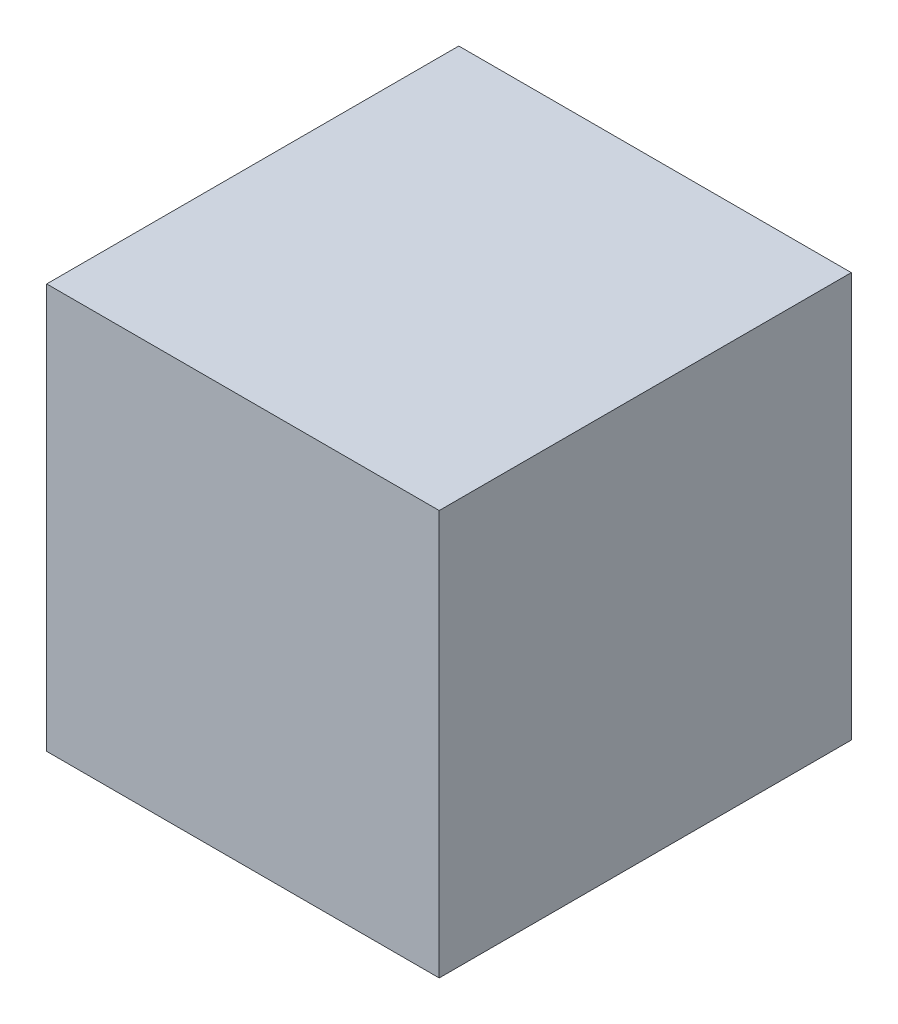
ISO-10303-21;
HEADER;
FILE_DESCRIPTION(('STEP AP214'),'2;1');
FILE_NAME('part.step','',(''),(''),'','','');
FILE_SCHEMA(('AUTOMOTIVE_DESIGN { 1 0 10303 214 1 1 1 1 }'));
ENDSEC;
DATA;
#1=APPLICATION_CONTEXT('core data for automotive mechanical design processes');
#2=APPLICATION_PROTOCOL_DEFINITION('international standard','automotive_design',2000,#1);
#3=PRODUCT_CONTEXT('',#1,'mechanical');
#4=PRODUCT('Part','Part','',(#3));
#5=PRODUCT_RELATED_PRODUCT_CATEGORY('part','',(#4));
#6=PRODUCT_DEFINITION_FORMATION('','',#4);
#7=PRODUCT_DEFINITION_CONTEXT('part definition',#1,'design');
#8=PRODUCT_DEFINITION('design','',#6,#7);
#9=PRODUCT_DEFINITION_SHAPE('','',#8);
#10=(LENGTH_UNIT() NAMED_UNIT(*) SI_UNIT(.MILLI.,.METRE.));
#11=(NAMED_UNIT(*) PLANE_ANGLE_UNIT() SI_UNIT($,.RADIAN.));
#12=(NAMED_UNIT(*) SI_UNIT($,.STERADIAN.) SOLID_ANGLE_UNIT());
#13=UNCERTAINTY_MEASURE_WITH_UNIT(LENGTH_MEASURE(1.E-05),#10,'distance_accuracy_value','');
#14=(GEOMETRIC_REPRESENTATION_CONTEXT(3) GLOBAL_UNCERTAINTY_ASSIGNED_CONTEXT((#13)) GLOBAL_UNIT_ASSIGNED_CONTEXT((#10,
#11,#12)) REPRESENTATION_CONTEXT('',''));
#15=CARTESIAN_POINT('',(0.,0.,0.));
#16=DIRECTION('',(0.,0.,1.));
#17=DIRECTION('',(1.,0.,0.));
#18=AXIS2_PLACEMENT_3D('',#15,#16,#17);
#19=CARTESIAN_POINT('',(0.,-29.6653277972811,40.));
#20=DIRECTION('',(0.,1.,0.));
#21=DIRECTION('',(-1.,0.,0.));
#22=AXIS2_PLACEMENT_3D('',#19,#20,#21);
#23=PLANE('',#22);
#24=DIRECTION('',(1.,0.,0.));
#25=VECTOR('',#24,1.);
#26=CARTESIAN_POINT('',(0.,-29.6653277972811,0.));
#27=LINE('',#26,#25);
#28=CARTESIAN_POINT('',(-9.03314366632912,-29.6653277972811,0.));
#29=VERTEX_POINT('',#28);
#30=CARTESIAN_POINT('',(29.0662585842205,-29.6653277972811,0.));
#31=VERTEX_POINT('',#30);
#32=EDGE_CURVE('E98',#29,#31,#27,.T.);
#33=ORIENTED_EDGE('',*,*,#32,.T.);
#34=DIRECTION('',(0.,0.,-1.));
#35=VECTOR('',#34,1.);
#36=CARTESIAN_POINT('',(29.0662585842205,-29.6653277972811,40.));
#37=LINE('',#36,#35);
#38=CARTESIAN_POINT('',(29.0662585842205,-29.6653277972811,40.));
#39=VERTEX_POINT('',#38);
#40=EDGE_CURVE('E11',#39,#31,#37,.T.);
#41=ORIENTED_EDGE('',*,*,#40,.F.);
#42=DIRECTION('',(1.,0.,0.));
#43=VECTOR('',#42,1.);
#44=CARTESIAN_POINT('',(0.,-29.6653277972811,40.));
#45=LINE('',#44,#43);
#46=CARTESIAN_POINT('',(-9.03314366632912,-29.6653277972811,40.));
#47=VERTEX_POINT('',#46);
#48=EDGE_CURVE('E84',#47,#39,#45,.T.);
#49=ORIENTED_EDGE('',*,*,#48,.F.);
#50=DIRECTION('',(0.,0.,-1.));
#51=VECTOR('',#50,1.);
#52=CARTESIAN_POINT('',(-9.03314366632912,-29.6653277972811,40.));
#53=LINE('',#52,#51);
#54=EDGE_CURVE('E51',#47,#29,#53,.T.);
#55=ORIENTED_EDGE('',*,*,#54,.T.);
#56=EDGE_LOOP('',(#33,#41,#49,#55));
#57=FACE_BOUND('',#56,.T.);
#58=ADVANCED_FACE('F35',(#57),#23,.F.);
#59=CARTESIAN_POINT('',(29.0662585842205,0.,40.));
#60=DIRECTION('',(-1.,0.,0.));
#61=DIRECTION('',(0.,0.,1.));
#62=AXIS2_PLACEMENT_3D('',#59,#60,#61);
#63=PLANE('',#62);
#64=DIRECTION('',(0.,1.,0.));
#65=VECTOR('',#64,1.);
#66=CARTESIAN_POINT('',(29.0662585842205,0.,0.));
#67=LINE('',#66,#65);
#68=CARTESIAN_POINT('',(29.0662585842205,9.63221287938977,0.));
#69=VERTEX_POINT('',#68);
#70=EDGE_CURVE('E89',#31,#69,#67,.T.);
#71=ORIENTED_EDGE('',*,*,#70,.T.);
#72=DIRECTION('',(0.,0.,-1.));
#73=VECTOR('',#72,1.);
#74=CARTESIAN_POINT('',(29.0662585842205,9.63221287938977,40.));
#75=LINE('',#74,#73);
#76=CARTESIAN_POINT('',(29.0662585842205,9.63221287938977,40.));
#77=VERTEX_POINT('',#76);
#78=EDGE_CURVE('E43',#77,#69,#75,.T.);
#79=ORIENTED_EDGE('',*,*,#78,.F.);
#80=DIRECTION('',(0.,1.,0.));
#81=VECTOR('',#80,1.);
#82=CARTESIAN_POINT('',(29.0662585842205,0.,40.));
#83=LINE('',#82,#81);
#84=EDGE_CURVE('E76',#39,#77,#83,.T.);
#85=ORIENTED_EDGE('',*,*,#84,.F.);
#86=ORIENTED_EDGE('',*,*,#40,.T.);
#87=EDGE_LOOP('',(#71,#79,#85,#86));
#88=FACE_BOUND('',#87,.T.);
#89=ADVANCED_FACE('F88',(#88),#63,.F.);
#90=CARTESIAN_POINT('',(0.,9.63221287938977,40.));
#91=DIRECTION('',(0.,1.,0.));
#92=DIRECTION('',(-1.,0.,0.));
#93=AXIS2_PLACEMENT_3D('',#90,#91,#92);
#94=PLANE('',#93);
#95=DIRECTION('',(1.,0.,0.));
#96=VECTOR('',#95,1.);
#97=CARTESIAN_POINT('',(0.,9.63221287938977,0.));
#98=LINE('',#97,#96);
#99=CARTESIAN_POINT('',(-9.03314366632913,9.63221287938977,0.));
#100=VERTEX_POINT('',#99);
#101=EDGE_CURVE('E102',#100,#69,#98,.T.);
#102=ORIENTED_EDGE('',*,*,#101,.F.);
#103=DIRECTION('',(0.,0.,-1.));
#104=VECTOR('',#103,1.);
#105=CARTESIAN_POINT('',(-9.03314366632913,9.63221287938977,40.));
#106=LINE('',#105,#104);
#107=CARTESIAN_POINT('',(-9.03314366632913,9.63221287938977,40.));
#108=VERTEX_POINT('',#107);
#109=EDGE_CURVE('E65',#108,#100,#106,.T.);
#110=ORIENTED_EDGE('',*,*,#109,.F.);
#111=DIRECTION('',(1.,0.,0.));
#112=VECTOR('',#111,1.);
#113=CARTESIAN_POINT('',(0.,9.63221287938977,40.));
#114=LINE('',#113,#112);
#115=EDGE_CURVE('E83',#108,#77,#114,.T.);
#116=ORIENTED_EDGE('',*,*,#115,.T.);
#117=ORIENTED_EDGE('',*,*,#78,.T.);
#118=EDGE_LOOP('',(#102,#110,#116,#117));
#119=FACE_BOUND('',#118,.T.);
#120=ADVANCED_FACE('F92',(#119),#94,.T.);
#121=CARTESIAN_POINT('',(-9.03314366632913,0.,40.));
#122=DIRECTION('',(-1.,0.,0.));
#123=DIRECTION('',(0.,-1.,0.));
#124=AXIS2_PLACEMENT_3D('',#121,#122,#123);
#125=PLANE('',#124);
#126=DIRECTION('',(0.,1.,0.));
#127=VECTOR('',#126,1.);
#128=CARTESIAN_POINT('',(-9.03314366632913,0.,0.));
#129=LINE('',#128,#127);
#130=EDGE_CURVE('E104',#29,#100,#129,.T.);
#131=ORIENTED_EDGE('',*,*,#130,.F.);
#132=ORIENTED_EDGE('',*,*,#54,.F.);
#133=DIRECTION('',(0.,1.,0.));
#134=VECTOR('',#133,1.);
#135=CARTESIAN_POINT('',(-9.03314366632913,0.,40.));
#136=LINE('',#135,#134);
#137=EDGE_CURVE('E93',#47,#108,#136,.T.);
#138=ORIENTED_EDGE('',*,*,#137,.T.);
#139=ORIENTED_EDGE('',*,*,#109,.T.);
#140=EDGE_LOOP('',(#131,#132,#138,#139));
#141=FACE_BOUND('',#140,.T.);
#142=ADVANCED_FACE('F131',(#141),#125,.T.);
#143=CARTESIAN_POINT('',(0.,0.,40.));
#144=DIRECTION('',(0.,0.,1.));
#145=DIRECTION('',(1.,0.,0.));
#146=AXIS2_PLACEMENT_3D('',#143,#144,#145);
#147=PLANE('',#146);
#148=ORIENTED_EDGE('',*,*,#48,.T.);
#149=ORIENTED_EDGE('',*,*,#84,.T.);
#150=ORIENTED_EDGE('',*,*,#115,.F.);
#151=ORIENTED_EDGE('',*,*,#137,.F.);
#152=EDGE_LOOP('',(#148,#149,#150,#151));
#153=FACE_BOUND('',#152,.T.);
#154=ADVANCED_FACE('F80',(#153),#147,.T.);
#155=CARTESIAN_POINT('',(0.,0.,0.));
#156=DIRECTION('',(0.,0.,1.));
#157=DIRECTION('',(1.,0.,0.));
#158=AXIS2_PLACEMENT_3D('',#155,#156,#157);
#159=PLANE('',#158);
#160=CARTESIAN_POINT('',(10.0165574589457,-10.0165574589457,0.));
#161=DIRECTION('',(0.,0.,1.));
#162=DIRECTION('',(1.,0.,0.));
#163=AXIS2_PLACEMENT_3D('',#160,#161,#162);
#164=CIRCLE('',#163,3.79708670005155);
#165=CARTESIAN_POINT('',(13.8136441589972,-10.0165574589457,0.));
#166=VERTEX_POINT('',#165);
#167=EDGE_CURVE('E110',#166,#166,#164,.T.);
#168=ORIENTED_EDGE('',*,*,#167,.T.);
#169=EDGE_LOOP('',(#168));
#170=FACE_BOUND('',#169,.T.);
#171=ORIENTED_EDGE('',*,*,#32,.F.);
#172=ORIENTED_EDGE('',*,*,#130,.T.);
#173=ORIENTED_EDGE('',*,*,#101,.T.);
#174=ORIENTED_EDGE('',*,*,#70,.F.);
#175=EDGE_LOOP('',(#171,#172,#173,#174));
#176=FACE_BOUND('',#175,.T.);
#177=ADVANCED_FACE('F125',(#170,#176),#159,.F.);
#178=CARTESIAN_POINT('',(10.0165574589457,-10.0165574589457,20.));
#179=DIRECTION('',(0.,0.,-1.));
#180=DIRECTION('',(-1.,0.,0.));
#181=AXIS2_PLACEMENT_3D('',#178,#179,#180);
#182=CYLINDRICAL_SURFACE('',#181,3.79708670005155);
#183=CARTESIAN_POINT('',(10.0165574589457,-10.0165574589457,20.));
#184=DIRECTION('',(0.,0.,1.));
#185=DIRECTION('',(1.,0.,0.));
#186=AXIS2_PLACEMENT_3D('',#183,#184,#185);
#187=CIRCLE('',#186,3.79708670005155);
#188=CARTESIAN_POINT('',(13.8136441589972,-10.0165574589457,20.));
#189=VERTEX_POINT('',#188);
#190=EDGE_CURVE('E100',#189,#189,#187,.T.);
#191=ORIENTED_EDGE('',*,*,#190,.T.);
#192=EDGE_LOOP('',(#191));
#193=FACE_BOUND('',#192,.T.);
#194=ORIENTED_EDGE('',*,*,#167,.F.);
#195=EDGE_LOOP('',(#194));
#196=FACE_BOUND('',#195,.T.);
#197=ADVANCED_FACE('F116',(#193,#196),#182,.F.);
#198=CARTESIAN_POINT('',(0.,0.,20.));
#199=DIRECTION('',(0.,0.,1.));
#200=DIRECTION('',(1.,0.,0.));
#201=AXIS2_PLACEMENT_3D('',#198,#199,#200);
#202=PLANE('',#201);
#203=ORIENTED_EDGE('',*,*,#190,.F.);
#204=EDGE_LOOP('',(#203));
#205=FACE_BOUND('',#204,.T.);
#206=ADVANCED_FACE('F119',(#205),#202,.F.);
#207=CLOSED_SHELL('',(#58,#89,#120,#142,#154,#177,#197,#206));
#208=MANIFOLD_SOLID_BREP('B2',#207);
#209=ADVANCED_BREP_SHAPE_REPRESENTATION('',(#18,#208),#14);
#210=SHAPE_DEFINITION_REPRESENTATION(#9,#209);
ENDSEC;
END-ISO-10303-21;
